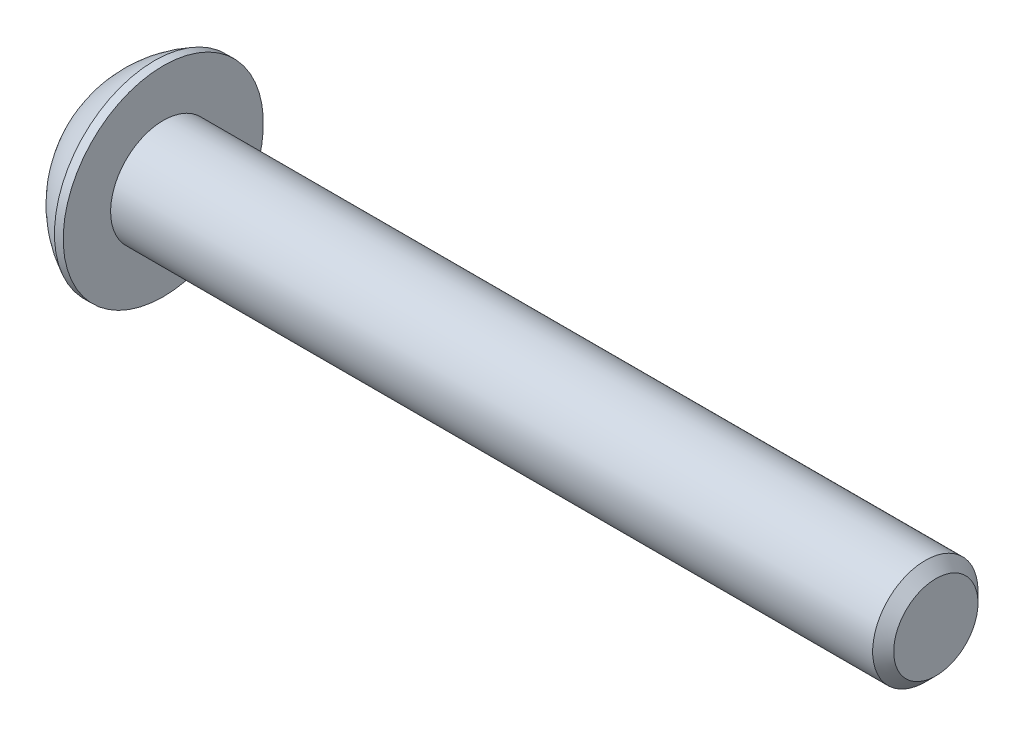
ISO-10303-21;
HEADER;
FILE_DESCRIPTION(('STEP AP214'),'2;1');
FILE_NAME('part.step','',(''),(''),'','','');
FILE_SCHEMA(('AUTOMOTIVE_DESIGN { 1 0 10303 214 1 1 1 1 }'));
ENDSEC;
DATA;
#1=APPLICATION_CONTEXT('core data for automotive mechanical design processes');
#2=APPLICATION_PROTOCOL_DEFINITION('international standard','automotive_design',2000,#1);
#3=PRODUCT_CONTEXT('',#1,'mechanical');
#4=PRODUCT('Part','Part','',(#3));
#5=PRODUCT_RELATED_PRODUCT_CATEGORY('part','',(#4));
#6=PRODUCT_DEFINITION_FORMATION('','',#4);
#7=PRODUCT_DEFINITION_CONTEXT('part definition',#1,'design');
#8=PRODUCT_DEFINITION('design','',#6,#7);
#9=PRODUCT_DEFINITION_SHAPE('','',#8);
#10=(LENGTH_UNIT() NAMED_UNIT(*) SI_UNIT(.MILLI.,.METRE.));
#11=(NAMED_UNIT(*) PLANE_ANGLE_UNIT() SI_UNIT($,.RADIAN.));
#12=(NAMED_UNIT(*) SI_UNIT($,.STERADIAN.) SOLID_ANGLE_UNIT());
#13=UNCERTAINTY_MEASURE_WITH_UNIT(LENGTH_MEASURE(1.E-05),#10,'distance_accuracy_value','');
#14=(GEOMETRIC_REPRESENTATION_CONTEXT(3) GLOBAL_UNCERTAINTY_ASSIGNED_CONTEXT((#13)) GLOBAL_UNIT_ASSIGNED_CONTEXT((#10,
#11,#12)) REPRESENTATION_CONTEXT('',''));
#15=CARTESIAN_POINT('',(0.,0.,0.));
#16=DIRECTION('',(0.,0.,1.));
#17=DIRECTION('',(1.,0.,0.));
#18=AXIS2_PLACEMENT_3D('',#15,#16,#17);
#19=CARTESIAN_POINT('',(-22.,0.,0.));
#20=DIRECTION('',(1.,0.,0.));
#21=DIRECTION('',(0.,0.,-1.));
#22=AXIS2_PLACEMENT_3D('',#19,#20,#21);
#23=CYLINDRICAL_SURFACE('',#22,1.5);
#24=CARTESIAN_POINT('',(-0.300000000000002,0.,0.));
#25=DIRECTION('',(1.,0.,0.));
#26=DIRECTION('',(0.,0.,-1.));
#27=AXIS2_PLACEMENT_3D('',#24,#25,#26);
#28=CIRCLE('',#27,1.5);
#29=CARTESIAN_POINT('',(-0.300000000000002,0.,-1.5));
#30=VERTEX_POINT('',#29);
#31=EDGE_CURVE('E47',#30,#30,#28,.F.);
#32=ORIENTED_EDGE('',*,*,#31,.T.);
#33=EDGE_LOOP('',(#32));
#34=FACE_BOUND('',#33,.T.);
#35=CARTESIAN_POINT('',(-22.,0.,0.));
#36=DIRECTION('',(-1.,0.,0.));
#37=DIRECTION('',(0.,-1.,0.));
#38=AXIS2_PLACEMENT_3D('',#35,#36,#37);
#39=CIRCLE('',#38,1.5);
#40=CARTESIAN_POINT('',(-22.,-1.50000000000001,0.));
#41=VERTEX_POINT('',#40);
#42=EDGE_CURVE('E130',#41,#41,#39,.F.);
#43=ORIENTED_EDGE('',*,*,#42,.T.);
#44=EDGE_LOOP('',(#43));
#45=FACE_BOUND('',#44,.T.);
#46=ADVANCED_FACE('F34',(#34,#45),#23,.T.);
#47=CARTESIAN_POINT('',(0.,0.,0.));
#48=DIRECTION('',(1.,0.,0.));
#49=DIRECTION('',(0.,0.,-1.));
#50=AXIS2_PLACEMENT_3D('',#47,#48,#49);
#51=PLANE('',#50);
#52=CARTESIAN_POINT('',(0.,0.,0.));
#53=DIRECTION('',(1.,0.,0.));
#54=DIRECTION('',(0.,0.,-1.));
#55=AXIS2_PLACEMENT_3D('',#52,#53,#54);
#56=CIRCLE('',#55,1.2);
#57=CARTESIAN_POINT('',(0.,0.,-1.2));
#58=VERTEX_POINT('',#57);
#59=EDGE_CURVE('E134',#58,#58,#56,.T.);
#60=ORIENTED_EDGE('',*,*,#59,.T.);
#61=EDGE_LOOP('',(#60));
#62=FACE_BOUND('',#61,.T.);
#63=ADVANCED_FACE('F149',(#62),#51,.T.);
#64=CARTESIAN_POINT('',(0.,0.,0.));
#65=DIRECTION('',(-1.,0.,0.));
#66=DIRECTION('',(0.,0.,1.));
#67=AXIS2_PLACEMENT_3D('',#64,#65,#66);
#68=CONICAL_SURFACE('',#67,1.2,0.785398163397452);
#69=ORIENTED_EDGE('',*,*,#31,.F.);
#70=EDGE_LOOP('',(#69));
#71=FACE_BOUND('',#70,.T.);
#72=ORIENTED_EDGE('',*,*,#59,.F.);
#73=EDGE_LOOP('',(#72));
#74=FACE_BOUND('',#73,.T.);
#75=ADVANCED_FACE('F36',(#71,#74),#68,.T.);
#76=CARTESIAN_POINT('',(-23.65,0.,0.));
#77=DIRECTION('',(1.,0.,0.));
#78=DIRECTION('',(0.,1.,0.));
#79=AXIS2_PLACEMENT_3D('',#76,#77,#78);
#80=PLANE('',#79);
#81=CARTESIAN_POINT('',(-23.65,0.,0.));
#82=DIRECTION('',(-1.,0.,0.));
#83=DIRECTION('',(0.,-1.,0.));
#84=AXIS2_PLACEMENT_3D('',#81,#82,#83);
#85=CIRCLE('',#84,1.20470053837926);
#86=CARTESIAN_POINT('',(-23.65,-1.20470053837928,0.));
#87=VERTEX_POINT('',#86);
#88=EDGE_CURVE('E377',#87,#87,#85,.T.);
#89=ORIENTED_EDGE('',*,*,#88,.F.);
#90=EDGE_LOOP('',(#89));
#91=FACE_BOUND('',#90,.T.);
#92=CARTESIAN_POINT('',(-23.65,0.,0.));
#93=DIRECTION('',(-1.,0.,0.));
#94=DIRECTION('',(0.,-1.,0.));
#95=AXIS2_PLACEMENT_3D('',#92,#93,#94);
#96=CIRCLE('',#95,1.5);
#97=CARTESIAN_POINT('',(-23.65,-1.5,0.));
#98=VERTEX_POINT('',#97);
#99=EDGE_CURVE('E126',#98,#98,#96,.T.);
#100=ORIENTED_EDGE('',*,*,#99,.T.);
#101=EDGE_LOOP('',(#100));
#102=FACE_BOUND('',#101,.T.);
#103=ADVANCED_FACE('F148',(#91,#102),#80,.F.);
#104=CARTESIAN_POINT('',(-20.8526785714286,0.,0.));
#105=DIRECTION('',(-1.,0.,0.));
#106=DIRECTION('',(0.,1.,0.));
#107=AXIS2_PLACEMENT_3D('',#104,#105,#106);
#108=SPHERICAL_SURFACE('',#107,3.17411517981703);
#109=ORIENTED_EDGE('',*,*,#99,.F.);
#110=EDGE_LOOP('',(#109));
#111=FACE_BOUND('',#110,.T.);
#112=CARTESIAN_POINT('',(-22.25,0.,0.));
#113=DIRECTION('',(-1.,0.,0.));
#114=DIRECTION('',(0.,-1.,0.));
#115=AXIS2_PLACEMENT_3D('',#112,#113,#114);
#116=CIRCLE('',#115,2.85);
#117=CARTESIAN_POINT('',(-22.25,-2.85,0.));
#118=VERTEX_POINT('',#117);
#119=EDGE_CURVE('E122',#118,#118,#116,.T.);
#120=ORIENTED_EDGE('',*,*,#119,.T.);
#121=EDGE_LOOP('',(#120));
#122=FACE_BOUND('',#121,.T.);
#123=ADVANCED_FACE('F160',(#111,#122),#108,.T.);
#124=CARTESIAN_POINT('',(-22.,0.,0.));
#125=DIRECTION('',(-1.,0.,0.));
#126=DIRECTION('',(0.,-1.,0.));
#127=AXIS2_PLACEMENT_3D('',#124,#125,#126);
#128=CYLINDRICAL_SURFACE('',#127,2.85);
#129=ORIENTED_EDGE('',*,*,#119,.F.);
#130=EDGE_LOOP('',(#129));
#131=FACE_BOUND('',#130,.T.);
#132=CARTESIAN_POINT('',(-22.,0.,0.));
#133=DIRECTION('',(-1.,0.,0.));
#134=DIRECTION('',(0.,-1.,0.));
#135=AXIS2_PLACEMENT_3D('',#132,#133,#134);
#136=CIRCLE('',#135,2.85);
#137=CARTESIAN_POINT('',(-22.,-2.85,0.));
#138=VERTEX_POINT('',#137);
#139=EDGE_CURVE('E118',#138,#138,#136,.T.);
#140=ORIENTED_EDGE('',*,*,#139,.T.);
#141=EDGE_LOOP('',(#140));
#142=FACE_BOUND('',#141,.T.);
#143=ADVANCED_FACE('F164',(#131,#142),#128,.T.);
#144=CARTESIAN_POINT('',(-22.,2.85,0.));
#145=DIRECTION('',(-1.,0.,0.));
#146=DIRECTION('',(0.,-1.,0.));
#147=AXIS2_PLACEMENT_3D('',#144,#145,#146);
#148=PLANE('',#147);
#149=ORIENTED_EDGE('',*,*,#42,.F.);
#150=EDGE_LOOP('',(#149));
#151=FACE_BOUND('',#150,.T.);
#152=ORIENTED_EDGE('',*,*,#139,.F.);
#153=EDGE_LOOP('',(#152));
#154=FACE_BOUND('',#153,.T.);
#155=ADVANCED_FACE('F168',(#151,#154),#148,.F.);
#156=CARTESIAN_POINT('',(-23.65,0.,0.));
#157=DIRECTION('',(-1.,0.,0.));
#158=DIRECTION('',(0.,-1.,0.));
#159=AXIS2_PLACEMENT_3D('',#156,#157,#158);
#160=CONICAL_SURFACE('',#159,1.20470053837926,0.78539816339745);
#161=ORIENTED_EDGE('',*,*,#88,.T.);
#162=EDGE_LOOP('',(#161));
#163=FACE_BOUND('',#162,.T.);
#164=CARTESIAN_POINT('',(-24.0125645579163,-1.20678079288098,1.));
#165=CARTESIAN_POINT('',(-23.9901238799752,-1.1776323938094,1.));
#166=CARTESIAN_POINT('',(-23.9678867609271,-1.1483277765504,1.));
#167=CARTESIAN_POINT('',(-23.9239053230859,-1.08934073997342,1.));
#168=CARTESIAN_POINT('',(-23.902161120887,-1.05965823380998,1.));
#169=CARTESIAN_POINT('',(-23.8374858802222,-0.969511619364399,1.));
#170=CARTESIAN_POINT('',(-23.795456442765,-0.908390032886429,1.));
#171=CARTESIAN_POINT('',(-23.7124203349119,-0.779849899214053,1.));
#172=CARTESIAN_POINT('',(-23.6716484956871,-0.71227804773398,1.));
#173=CARTESIAN_POINT('',(-23.5967056855402,-0.573692441836196,1.));
#174=CARTESIAN_POINT('',(-23.5625124208036,-0.502691370033607,1.));
#175=CARTESIAN_POINT('',(-23.5206648240494,-0.396633108483685,1.));
#176=CARTESIAN_POINT('',(-23.508752424601,-0.363265114723113,1.));
#177=CARTESIAN_POINT('',(-23.4876010580815,-0.29567514486371,1.));
#178=CARTESIAN_POINT('',(-23.4783622608543,-0.26145311466105,1.));
#179=CARTESIAN_POINT('',(-23.4632108375931,-0.192964714439445,1.));
#180=CARTESIAN_POINT('',(-23.4572372079353,-0.15871206270245,1.));
#181=CARTESIAN_POINT('',(-23.4487381792859,-0.0897678989598084,1.));
#182=CARTESIAN_POINT('',(-23.4462131691607,-0.0550763379078104,1.));
#183=CARTESIAN_POINT('',(-23.4448308242394,0.0128534343371815,1.));
#184=CARTESIAN_POINT('',(-23.4458171333425,0.0460884918414469,1.));
#185=CARTESIAN_POINT('',(-23.4510428296463,0.112288777523335,1.));
#186=CARTESIAN_POINT('',(-23.4552814228284,0.145254069576908,1.));
#187=CARTESIAN_POINT('',(-23.4668431932388,0.211252641710455,1.));
#188=CARTESIAN_POINT('',(-23.4742213991969,0.244276126106397,1.));
#189=CARTESIAN_POINT('',(-23.4916537633013,0.309593416178887,1.));
#190=CARTESIAN_POINT('',(-23.5017077720937,0.341887262472118,1.));
#191=CARTESIAN_POINT('',(-23.5364692676108,0.441188556116696,1.));
#192=CARTESIAN_POINT('',(-23.5650343603337,0.506841480843466,1.));
#193=CARTESIAN_POINT('',(-23.6286033694253,0.635081389212351,1.));
#194=CARTESIAN_POINT('',(-23.663629955309,0.697656564069511,1.));
#195=CARTESIAN_POINT('',(-23.7359546107891,0.8172743696946,1.));
#196=CARTESIAN_POINT('',(-23.7730556162911,0.874437672313569,1.));
#197=CARTESIAN_POINT('',(-23.8304371678966,0.958655710303473,1.));
#198=CARTESIAN_POINT('',(-23.8497720189249,0.98636616376694,1.));
#199=CARTESIAN_POINT('',(-23.8889602713879,1.04140691974408,1.));
#200=CARTESIAN_POINT('',(-23.908813529201,1.0687373243988,1.));
#201=CARTESIAN_POINT('',(-23.92888195229,1.09590921458868,1.));
#202=B_SPLINE_CURVE_WITH_KNOTS('',3,(#164,#165,#166,#167,#168,#169,#170,#171,#172,#173,#174,
#175,#176,#177,#178,#179,#180,#181,#182,#183,#184,#185,#186,#187,#188,#189,#190,#191,#192,#193,
#194,#195,#196,#197,#198,#199,#200,#201),.UNSPECIFIED.,.F.,.F.,(4,2,2,2,2,2,2,2,2,2,2,2,2,2,2,2,
2,2,4),(0.,0.110355487284534,0.220736811203829,0.443178348562915,0.67975933518112,
0.915523888816468,1.02172703810025,1.1279369325962,1.23208803653003,1.33625088357217,
1.43583459192535,1.53539399546241,1.63677534642524,1.73815103982916,1.95232008261278,
2.16725532249797,2.37159620059983,2.47295962852456,2.57429526618464),.UNSPECIFIED.);
#203=CARTESIAN_POINT('',(-23.6,-0.577350269189646,1.));
#204=VERTEX_POINT('',#203);
#205=CARTESIAN_POINT('',(-23.6,0.577350269189605,1.));
#206=VERTEX_POINT('',#205);
#207=EDGE_CURVE('E102',#204,#206,#202,.T.);
#208=ORIENTED_EDGE('',*,*,#207,.F.);
#209=CARTESIAN_POINT('',(-23.6001154873726,-1.15481600843311,-0.000200000000000284));
#210=CARTESIAN_POINT('',(-23.5802779308257,-1.13496520795028,0.0341825950071803));
#211=CARTESIAN_POINT('',(-23.5616050206389,-1.11478247255944,0.0691401181398242));
#212=CARTESIAN_POINT('',(-23.5274147427231,-1.07362739529221,0.140422802956089));
#213=CARTESIAN_POINT('',(-23.5119164090234,-1.05265113558082,0.176754750528983));
#214=CARTESIAN_POINT('',(-23.4853673071423,-1.01035337909805,0.250016613803311));
#215=CARTESIAN_POINT('',(-23.4742497739969,-0.989042666109261,0.286927851445414));
#216=CARTESIAN_POINT('',(-23.4571198657762,-0.945952199282712,0.361562729310859));
#217=CARTESIAN_POINT('',(-23.4510946974667,-0.924173762626617,0.399284088108635));
#218=CARTESIAN_POINT('',(-23.4456605549675,-0.886641312640035,0.464292198417933));
#219=CARTESIAN_POINT('',(-23.4448569383167,-0.870936130672296,0.491494371528172));
#220=CARTESIAN_POINT('',(-23.4462066994169,-0.839556179862869,0.545846040669111));
#221=CARTESIAN_POINT('',(-23.4483607295472,-0.823881418494944,0.572995523754875));
#222=CARTESIAN_POINT('',(-23.4591169721285,-0.777080970599387,0.65405627732696));
#223=CARTESIAN_POINT('',(-23.4720145564153,-0.746188191116451,0.707564140978427));
#224=CARTESIAN_POINT('',(-23.5031407306022,-0.691968116419669,0.801476065143432));
#225=CARTESIAN_POINT('',(-23.5197377977018,-0.668386557293391,0.842320523671835));
#226=CARTESIAN_POINT('',(-23.5571249246853,-0.622147085933701,0.922409637381944));
#227=CARTESIAN_POINT('',(-23.5779013418174,-0.599486449584595,0.961659010870437));
#228=CARTESIAN_POINT('',(-23.6001154873726,-0.577234799135809,1.0002));
#229=B_SPLINE_CURVE_WITH_KNOTS('',3,(#209,#210,#211,#212,#213,#214,#215,#216,#217,#218,#219,
#220,#221,#222,#223,#224,#225,#226,#227,#228),.UNSPECIFIED.,.F.,.F.,(4,2,2,2,2,2,2,2,2,4),(0.,
0.133237676828558,0.267252229834489,0.399137076269299,0.530689603280767,0.624814864263845,
0.718960890149132,0.907306626112097,1.0571010036179,1.20641411519286),.UNSPECIFIED.);
#230=CARTESIAN_POINT('',(-23.6,-1.15470053837927,0.));
#231=VERTEX_POINT('',#230);
#232=EDGE_CURVE('E210',#231,#204,#229,.T.);
#233=ORIENTED_EDGE('',*,*,#232,.F.);
#234=CARTESIAN_POINT('',(-23.6001154873726,-0.577234799135808,-1.0002));
#235=CARTESIAN_POINT('',(-23.5802779308257,-0.597085599618641,-0.96581740499282));
#236=CARTESIAN_POINT('',(-23.5616050206389,-0.617268335009476,-0.930859881860175));
#237=CARTESIAN_POINT('',(-23.5274147427231,-0.658423412276706,-0.85957719704391));
#238=CARTESIAN_POINT('',(-23.5119164090234,-0.6793996719881,-0.823245249471016));
#239=CARTESIAN_POINT('',(-23.4853673071423,-0.721697428470867,-0.749983386196689));
#240=CARTESIAN_POINT('',(-23.4742497739969,-0.743008141459657,-0.713072148554586));
#241=CARTESIAN_POINT('',(-23.4571198657762,-0.786098608286206,-0.638437270689141));
#242=CARTESIAN_POINT('',(-23.4510946974667,-0.807877044942301,-0.600715911891364));
#243=CARTESIAN_POINT('',(-23.4456605549675,-0.845409494928883,-0.535707801582066));
#244=CARTESIAN_POINT('',(-23.4448569383167,-0.861114676896622,-0.508505628471828));
#245=CARTESIAN_POINT('',(-23.4462066994169,-0.892494627706049,-0.454153959330888));
#246=CARTESIAN_POINT('',(-23.4483607295472,-0.908169389073974,-0.427004476245124));
#247=CARTESIAN_POINT('',(-23.4591169721285,-0.954969836969531,-0.34594372267304));
#248=CARTESIAN_POINT('',(-23.4720145564153,-0.985862616452468,-0.292435859021572));
#249=CARTESIAN_POINT('',(-23.5031407306022,-1.04008269114925,-0.198523934856568));
#250=CARTESIAN_POINT('',(-23.5197377977018,-1.06366425027553,-0.157679476328166));
#251=CARTESIAN_POINT('',(-23.5571249246853,-1.10990372163522,-0.0775903626180571));
#252=CARTESIAN_POINT('',(-23.5779013418174,-1.13256435798432,-0.0383409891295633));
#253=CARTESIAN_POINT('',(-23.6001154873726,-1.15481600843311,0.000199999999999115));
#254=B_SPLINE_CURVE_WITH_KNOTS('',3,(#234,#235,#236,#237,#238,#239,#240,#241,#242,#243,#244,
#245,#246,#247,#248,#249,#250,#251,#252,#253),.UNSPECIFIED.,.F.,.F.,(4,2,2,2,2,2,2,2,2,4),(0.,
0.13323767682856,0.267252229834489,0.399137076269299,0.530689603280768,0.624814864263846,
0.718960890149132,0.907306626112097,1.05710100361789,1.20641411519286),.UNSPECIFIED.);
#255=CARTESIAN_POINT('',(-23.6,-0.577350269189646,-1.));
#256=VERTEX_POINT('',#255);
#257=EDGE_CURVE('E205',#256,#231,#254,.T.);
#258=ORIENTED_EDGE('',*,*,#257,.F.);
#259=CARTESIAN_POINT('',(-24.0125650614172,-1.20678144678533,-1.));
#260=CARTESIAN_POINT('',(-23.9901243639822,-1.17763302882146,-1.));
#261=CARTESIAN_POINT('',(-23.9678872254711,-1.14832839261354,-1.));
#262=CARTESIAN_POINT('',(-23.9239057488155,-1.08934131795807,-1.));
#263=CARTESIAN_POINT('',(-23.9021615272652,-1.059658792665,-1.));
#264=CARTESIAN_POINT('',(-23.837486228163,-0.969512119697562,-1.));
#265=CARTESIAN_POINT('',(-23.7954567519025,-0.908390493450879,-1.));
#266=CARTESIAN_POINT('',(-23.7124205639502,-0.779850272991524,-1.));
#267=CARTESIAN_POINT('',(-23.67164868372,-0.712278374260663,-1.));
#268=CARTESIAN_POINT('',(-23.5967057974366,-0.573692669877708,-1.));
#269=CARTESIAN_POINT('',(-23.5625124975185,-0.502691546874024,-1.));
#270=CARTESIAN_POINT('',(-23.5206648756311,-0.396633247078009,-1.));
#271=CARTESIAN_POINT('',(-23.5087524781389,-0.363265269879175,-1.));
#272=CARTESIAN_POINT('',(-23.4876011122146,-0.295675333788417,-1.));
#273=CARTESIAN_POINT('',(-23.4783623136284,-0.261453320792008,-1.));
#274=CARTESIAN_POINT('',(-23.4632108836686,-0.192964954456364,-1.));
#275=CARTESIAN_POINT('',(-23.4572372487852,-0.158712319385996,-1.));
#276=CARTESIAN_POINT('',(-23.4487382057865,-0.0897681885430111,-1.));
#277=CARTESIAN_POINT('',(-23.446213186537,-0.05507664372401,-1.));
#278=CARTESIAN_POINT('',(-23.4448308203586,0.0128531008985226,-1.));
#279=CARTESIAN_POINT('',(-23.445817117779,0.0460881469709354,-1.));
#280=CARTESIAN_POINT('',(-23.4510427890575,0.112288411077507,-1.));
#281=CARTESIAN_POINT('',(-23.4552813688957,0.14525369298744,-1.));
#282=CARTESIAN_POINT('',(-23.4668431114854,0.211252245100392,-1.));
#283=CARTESIAN_POINT('',(-23.474221302878,0.244275719655881,-1.));
#284=CARTESIAN_POINT('',(-23.4916536376949,0.309592991103803,-1.));
#285=CARTESIAN_POINT('',(-23.5017076317658,0.341886828612767,-1.));
#286=CARTESIAN_POINT('',(-23.5364690589811,0.441188030105094,-1.));
#287=CARTESIAN_POINT('',(-23.5650340890574,0.506840876086047,-1.));
#288=CARTESIAN_POINT('',(-23.6286029659001,0.635080633024404,-1.));
#289=CARTESIAN_POINT('',(-23.663629482132,0.697655735233984,-1.));
#290=CARTESIAN_POINT('',(-23.7359540043354,0.817273410459762,-1.));
#291=CARTESIAN_POINT('',(-23.7730549468408,0.874436654853316,-1.));
#292=CARTESIAN_POINT('',(-23.8304364042781,0.958654606765343,-1.));
#293=CARTESIAN_POINT('',(-23.8497712241667,0.98636503195223,-1.));
#294=CARTESIAN_POINT('',(-23.8889594143893,1.04140573156298,-1.));
#295=CARTESIAN_POINT('',(-23.9088126411017,1.06873610812793,-1.));
#296=CARTESIAN_POINT('',(-23.9288810331298,1.09590797027906,-1.));
#297=B_SPLINE_CURVE_WITH_KNOTS('',3,(#259,#260,#261,#262,#263,#264,#265,#266,#267,#268,#269,
#270,#271,#272,#273,#274,#275,#276,#277,#278,#279,#280,#281,#282,#283,#284,#285,#286,#287,#288,
#289,#290,#291,#292,#293,#294,#295,#296),.UNSPECIFIED.,.F.,.F.,(4,2,2,2,2,2,2,2,2,2,2,2,2,2,2,2,
2,2,4),(0.,0.110355567866854,0.220736972391891,0.44317867397924,0.679759845471899,
0.915524582194851,1.02172768288056,1.12793752886233,1.23208858652571,1.33625138728838,
1.43583506047458,1.53539442879914,1.63677574143709,1.73815139653142,1.95232014898535,
2.16725509662759,2.3715957252827,2.47295903017567,2.57429454481414),.UNSPECIFIED.);
#298=CARTESIAN_POINT('',(-23.6,0.577350269189606,-1.));
#299=VERTEX_POINT('',#298);
#300=EDGE_CURVE('E54',#299,#256,#297,.F.);
#301=ORIENTED_EDGE('',*,*,#300,.F.);
#302=CARTESIAN_POINT('',(-23.6001154873726,1.15481600843307,0.000200000000000217));
#303=CARTESIAN_POINT('',(-23.5802779308257,1.13496520795024,-0.0341825950071804));
#304=CARTESIAN_POINT('',(-23.5616050206389,1.1147824725594,-0.0691401181398242));
#305=CARTESIAN_POINT('',(-23.5274147427231,1.07362739529217,-0.140422802956089));
#306=CARTESIAN_POINT('',(-23.5119164090234,1.05265113558078,-0.176754750528983));
#307=CARTESIAN_POINT('',(-23.4853673071423,1.01035337909801,-0.25001661380331));
#308=CARTESIAN_POINT('',(-23.4742497739969,0.98904266610922,-0.286927851445414));
#309=CARTESIAN_POINT('',(-23.4571198657762,0.945952199282671,-0.361562729310859));
#310=CARTESIAN_POINT('',(-23.4510946974667,0.924173762626576,-0.399284088108635));
#311=CARTESIAN_POINT('',(-23.4456605549675,0.886641312639994,-0.464292198417933));
#312=CARTESIAN_POINT('',(-23.4448569383167,0.870936130672255,-0.491494371528172));
#313=CARTESIAN_POINT('',(-23.4462066994169,0.839556179862828,-0.545846040669112));
#314=CARTESIAN_POINT('',(-23.4483607295472,0.823881418494903,-0.572995523754875));
#315=CARTESIAN_POINT('',(-23.4591169721285,0.777080970599346,-0.65405627732696));
#316=CARTESIAN_POINT('',(-23.4720145564153,0.74618819111641,-0.707564140978427));
#317=CARTESIAN_POINT('',(-23.5031407306022,0.691968116419629,-0.801476065143431));
#318=CARTESIAN_POINT('',(-23.5197377977018,0.668386557293351,-0.842320523671834));
#319=CARTESIAN_POINT('',(-23.5571249246853,0.622147085933661,-0.922409637381944));
#320=CARTESIAN_POINT('',(-23.5779013418174,0.599486449584555,-0.961659010870438));
#321=CARTESIAN_POINT('',(-23.6001154873726,0.577234799135768,-1.0002));
#322=B_SPLINE_CURVE_WITH_KNOTS('',3,(#302,#303,#304,#305,#306,#307,#308,#309,#310,#311,#312,
#313,#314,#315,#316,#317,#318,#319,#320,#321),.UNSPECIFIED.,.F.,.F.,(4,2,2,2,2,2,2,2,2,4),(0.,
0.133237676828557,0.267252229834489,0.399137076269299,0.530689603280767,0.624814864263845,
0.718960890149132,0.907306626112097,1.05710100361789,1.20641411519286),.UNSPECIFIED.);
#323=CARTESIAN_POINT('',(-23.6,1.15470053837923,0.));
#324=VERTEX_POINT('',#323);
#325=EDGE_CURVE('E11',#324,#299,#322,.T.);
#326=ORIENTED_EDGE('',*,*,#325,.F.);
#327=CARTESIAN_POINT('',(-23.6001154873726,0.577234799135767,1.0002));
#328=CARTESIAN_POINT('',(-23.5802779308257,0.5970855996186,0.96581740499282));
#329=CARTESIAN_POINT('',(-23.5616050206389,0.617268335009435,0.930859881860176));
#330=CARTESIAN_POINT('',(-23.5274147427231,0.658423412276665,0.859577197043911));
#331=CARTESIAN_POINT('',(-23.5119164090234,0.679399671988059,0.823245249471016));
#332=CARTESIAN_POINT('',(-23.4853673071423,0.721697428470826,0.749983386196689));
#333=CARTESIAN_POINT('',(-23.4742497739969,0.743008141459616,0.713072148554586));
#334=CARTESIAN_POINT('',(-23.4571198657762,0.786098608286166,0.638437270689141));
#335=CARTESIAN_POINT('',(-23.4510946974667,0.807877044942261,0.600715911891364));
#336=CARTESIAN_POINT('',(-23.4456605549675,0.845409494928843,0.535707801582066));
#337=CARTESIAN_POINT('',(-23.4448569383167,0.861114676896582,0.508505628471827));
#338=CARTESIAN_POINT('',(-23.4462066994169,0.892494627706009,0.454153959330887));
#339=CARTESIAN_POINT('',(-23.4483607295472,0.908169389073934,0.427004476245123));
#340=CARTESIAN_POINT('',(-23.4591169721285,0.954969836969491,0.345943722673039));
#341=CARTESIAN_POINT('',(-23.4720145564153,0.985862616452427,0.292435859021572));
#342=CARTESIAN_POINT('',(-23.5031407306022,1.04008269114921,0.198523934856567));
#343=CARTESIAN_POINT('',(-23.5197377977018,1.06366425027549,0.157679476328164));
#344=CARTESIAN_POINT('',(-23.5571249246853,1.10990372163518,0.0775903626180551));
#345=CARTESIAN_POINT('',(-23.5779013418174,1.13256435798428,0.038340989129562));
#346=CARTESIAN_POINT('',(-23.6001154873726,1.15481600843307,-0.000199999999999525));
#347=B_SPLINE_CURVE_WITH_KNOTS('',3,(#327,#328,#329,#330,#331,#332,#333,#334,#335,#336,#337,
#338,#339,#340,#341,#342,#343,#344,#345,#346),.UNSPECIFIED.,.F.,.F.,(4,2,2,2,2,2,2,2,2,4),(0.,
0.133237676828559,0.267252229834489,0.399137076269299,0.530689603280768,0.624814864263846,
0.718960890149133,0.907306626112098,1.0571010036179,1.20641411519286),.UNSPECIFIED.);
#348=EDGE_CURVE('E92',#206,#324,#347,.T.);
#349=ORIENTED_EDGE('',*,*,#348,.F.);
#350=EDGE_LOOP('',(#208,#233,#258,#301,#326,#349));
#351=FACE_BOUND('',#350,.T.);
#352=ADVANCED_FACE('F91',(#163,#351),#160,.F.);
#353=CARTESIAN_POINT('',(-22.45,0.,0.));
#354=DIRECTION('',(-1.,0.,0.));
#355=DIRECTION('',(0.,0.,1.));
#356=AXIS2_PLACEMENT_3D('',#353,#354,#355);
#357=PLANE('',#356);
#358=DIRECTION('',(0.,0.5,-0.866025403784439));
#359=VECTOR('',#358,1.);
#360=CARTESIAN_POINT('',(-22.45,0.577350269189605,1.));
#361=LINE('',#360,#359);
#362=CARTESIAN_POINT('',(-22.45,0.577350269189605,1.));
#363=VERTEX_POINT('',#362);
#364=CARTESIAN_POINT('',(-22.45,1.15470053837923,0.));
#365=VERTEX_POINT('',#364);
#366=EDGE_CURVE('E101',#363,#365,#361,.T.);
#367=ORIENTED_EDGE('',*,*,#366,.T.);
#368=DIRECTION('',(0.,-0.5,-0.866025403784439));
#369=VECTOR('',#368,1.);
#370=CARTESIAN_POINT('',(-22.45,1.15470053837923,0.));
#371=LINE('',#370,#369);
#372=CARTESIAN_POINT('',(-22.45,0.577350269189605,-1.));
#373=VERTEX_POINT('',#372);
#374=EDGE_CURVE('E106',#365,#373,#371,.T.);
#375=ORIENTED_EDGE('',*,*,#374,.T.);
#376=DIRECTION('',(0.,-1.,0.));
#377=VECTOR('',#376,1.);
#378=CARTESIAN_POINT('',(-22.45,0.577350269189605,-1.));
#379=LINE('',#378,#377);
#380=CARTESIAN_POINT('',(-22.45,-0.577350269189646,-1.));
#381=VERTEX_POINT('',#380);
#382=EDGE_CURVE('E236',#373,#381,#379,.T.);
#383=ORIENTED_EDGE('',*,*,#382,.T.);
#384=DIRECTION('',(0.,-0.5,0.866025403784438));
#385=VECTOR('',#384,1.);
#386=CARTESIAN_POINT('',(-22.45,-0.577350269189646,-1.));
#387=LINE('',#386,#385);
#388=CARTESIAN_POINT('',(-22.45,-1.15470053837927,0.));
#389=VERTEX_POINT('',#388);
#390=EDGE_CURVE('E241',#381,#389,#387,.T.);
#391=ORIENTED_EDGE('',*,*,#390,.T.);
#392=DIRECTION('',(0.,0.5,0.866025403784439));
#393=VECTOR('',#392,1.);
#394=CARTESIAN_POINT('',(-22.45,-1.15470053837927,0.));
#395=LINE('',#394,#393);
#396=CARTESIAN_POINT('',(-22.45,-0.577350269189647,1.));
#397=VERTEX_POINT('',#396);
#398=EDGE_CURVE('E114',#389,#397,#395,.T.);
#399=ORIENTED_EDGE('',*,*,#398,.T.);
#400=DIRECTION('',(0.,1.,0.));
#401=VECTOR('',#400,1.);
#402=CARTESIAN_POINT('',(-22.45,-0.577350269189647,1.));
#403=LINE('',#402,#401);
#404=EDGE_CURVE('E109',#397,#363,#403,.T.);
#405=ORIENTED_EDGE('',*,*,#404,.T.);
#406=EDGE_LOOP('',(#367,#375,#383,#391,#399,#405));
#407=FACE_BOUND('',#406,.T.);
#408=ADVANCED_FACE('F192',(#407),#357,.T.);
#409=CARTESIAN_POINT('',(-22.45,1.15470053837923,0.));
#410=DIRECTION('',(0.,0.866025403784439,-0.5));
#411=DIRECTION('',(0.,0.5,0.866025403784439));
#412=AXIS2_PLACEMENT_3D('',#409,#410,#411);
#413=PLANE('',#412);
#414=DIRECTION('',(-1.,0.,0.));
#415=VECTOR('',#414,1.);
#416=CARTESIAN_POINT('',(-22.45,1.15470053837923,0.));
#417=LINE('',#416,#415);
#418=EDGE_CURVE('E98',#365,#324,#417,.T.);
#419=ORIENTED_EDGE('',*,*,#418,.T.);
#420=ORIENTED_EDGE('',*,*,#325,.T.);
#421=DIRECTION('',(-1.,0.,0.));
#422=VECTOR('',#421,1.);
#423=CARTESIAN_POINT('',(-22.45,0.577350269189605,-1.));
#424=LINE('',#423,#422);
#425=EDGE_CURVE('E108',#373,#299,#424,.T.);
#426=ORIENTED_EDGE('',*,*,#425,.F.);
#427=ORIENTED_EDGE('',*,*,#374,.F.);
#428=EDGE_LOOP('',(#419,#420,#426,#427));
#429=FACE_BOUND('',#428,.T.);
#430=ADVANCED_FACE('F104',(#429),#413,.F.);
#431=CARTESIAN_POINT('',(-22.45,0.577350269189605,-1.));
#432=DIRECTION('',(0.,0.,-1.));
#433=DIRECTION('',(0.,1.,0.));
#434=AXIS2_PLACEMENT_3D('',#431,#432,#433);
#435=PLANE('',#434);
#436=ORIENTED_EDGE('',*,*,#425,.T.);
#437=ORIENTED_EDGE('',*,*,#300,.T.);
#438=DIRECTION('',(-1.,0.,0.));
#439=VECTOR('',#438,1.);
#440=CARTESIAN_POINT('',(-22.45,-0.577350269189646,-1.));
#441=LINE('',#440,#439);
#442=EDGE_CURVE('E111',#381,#256,#441,.T.);
#443=ORIENTED_EDGE('',*,*,#442,.F.);
#444=ORIENTED_EDGE('',*,*,#382,.F.);
#445=EDGE_LOOP('',(#436,#437,#443,#444));
#446=FACE_BOUND('',#445,.T.);
#447=ADVANCED_FACE('F225',(#446),#435,.F.);
#448=CARTESIAN_POINT('',(-22.45,-0.577350269189646,-1.));
#449=DIRECTION('',(0.,-0.866025403784439,-0.5));
#450=DIRECTION('',(0.,0.5,-0.866025403784439));
#451=AXIS2_PLACEMENT_3D('',#448,#449,#450);
#452=PLANE('',#451);
#453=ORIENTED_EDGE('',*,*,#442,.T.);
#454=ORIENTED_EDGE('',*,*,#257,.T.);
#455=DIRECTION('',(-1.,0.,0.));
#456=VECTOR('',#455,1.);
#457=CARTESIAN_POINT('',(-22.45,-1.15470053837927,0.));
#458=LINE('',#457,#456);
#459=EDGE_CURVE('E259',#389,#231,#458,.T.);
#460=ORIENTED_EDGE('',*,*,#459,.F.);
#461=ORIENTED_EDGE('',*,*,#390,.F.);
#462=EDGE_LOOP('',(#453,#454,#460,#461));
#463=FACE_BOUND('',#462,.T.);
#464=ADVANCED_FACE('F220',(#463),#452,.F.);
#465=CARTESIAN_POINT('',(-22.45,-1.15470053837927,0.));
#466=DIRECTION('',(0.,-0.866025403784439,0.5));
#467=DIRECTION('',(0.,-0.5,-0.866025403784439));
#468=AXIS2_PLACEMENT_3D('',#465,#466,#467);
#469=PLANE('',#468);
#470=ORIENTED_EDGE('',*,*,#459,.T.);
#471=ORIENTED_EDGE('',*,*,#232,.T.);
#472=DIRECTION('',(-1.,0.,0.));
#473=VECTOR('',#472,1.);
#474=CARTESIAN_POINT('',(-22.45,-0.577350269189647,1.));
#475=LINE('',#474,#473);
#476=EDGE_CURVE('E255',#397,#204,#475,.T.);
#477=ORIENTED_EDGE('',*,*,#476,.F.);
#478=ORIENTED_EDGE('',*,*,#398,.F.);
#479=EDGE_LOOP('',(#470,#471,#477,#478));
#480=FACE_BOUND('',#479,.T.);
#481=ADVANCED_FACE('F217',(#480),#469,.F.);
#482=CARTESIAN_POINT('',(-22.45,-0.577350269189647,1.));
#483=DIRECTION('',(0.,0.,1.));
#484=DIRECTION('',(1.,0.,0.));
#485=AXIS2_PLACEMENT_3D('',#482,#483,#484);
#486=PLANE('',#485);
#487=ORIENTED_EDGE('',*,*,#476,.T.);
#488=ORIENTED_EDGE('',*,*,#207,.T.);
#489=DIRECTION('',(-1.,0.,0.));
#490=VECTOR('',#489,1.);
#491=CARTESIAN_POINT('',(-22.45,0.577350269189605,1.));
#492=LINE('',#491,#490);
#493=EDGE_CURVE('E61',#363,#206,#492,.T.);
#494=ORIENTED_EDGE('',*,*,#493,.F.);
#495=ORIENTED_EDGE('',*,*,#404,.F.);
#496=EDGE_LOOP('',(#487,#488,#494,#495));
#497=FACE_BOUND('',#496,.T.);
#498=ADVANCED_FACE('F175',(#497),#486,.F.);
#499=CARTESIAN_POINT('',(-22.45,0.577350269189605,1.));
#500=DIRECTION('',(0.,0.866025403784439,0.5));
#501=DIRECTION('',(0.,-0.5,0.866025403784439));
#502=AXIS2_PLACEMENT_3D('',#499,#500,#501);
#503=PLANE('',#502);
#504=ORIENTED_EDGE('',*,*,#493,.T.);
#505=ORIENTED_EDGE('',*,*,#348,.T.);
#506=ORIENTED_EDGE('',*,*,#418,.F.);
#507=ORIENTED_EDGE('',*,*,#366,.F.);
#508=EDGE_LOOP('',(#504,#505,#506,#507));
#509=FACE_BOUND('',#508,.T.);
#510=ADVANCED_FACE('F97',(#509),#503,.F.);
#511=CLOSED_SHELL('',(#46,#63,#75,#103,#123,#143,#155,#352,#408,#430,#447,#464,#481,#498,#510));
#512=MANIFOLD_SOLID_BREP('B2',#511);
#513=ADVANCED_BREP_SHAPE_REPRESENTATION('',(#18,#512),#14);
#514=SHAPE_DEFINITION_REPRESENTATION(#9,#513);
ENDSEC;
END-ISO-10303-21;
